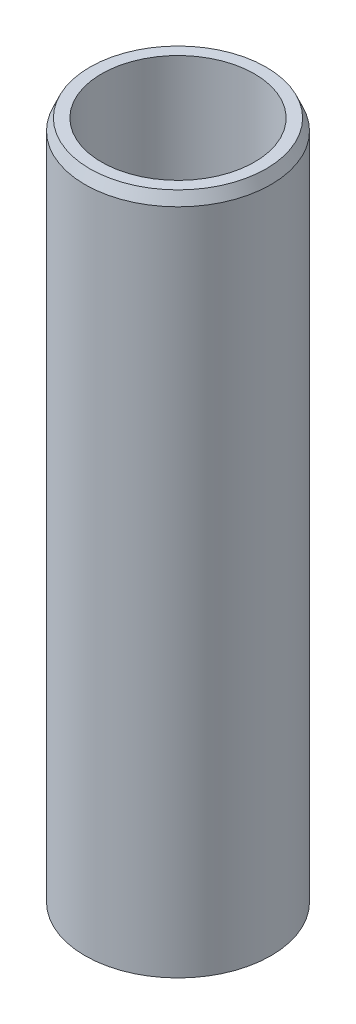
ISO-10303-21;
HEADER;
FILE_DESCRIPTION(('STEP AP214'),'2;1');
FILE_NAME('part.step','',(''),(''),'','','');
FILE_SCHEMA(('AUTOMOTIVE_DESIGN { 1 0 10303 214 1 1 1 1 }'));
ENDSEC;
DATA;
#1=APPLICATION_CONTEXT('core data for automotive mechanical design processes');
#2=APPLICATION_PROTOCOL_DEFINITION('international standard','automotive_design',2000,#1);
#3=PRODUCT_CONTEXT('',#1,'mechanical');
#4=PRODUCT('Part','Part','',(#3));
#5=PRODUCT_RELATED_PRODUCT_CATEGORY('part','',(#4));
#6=PRODUCT_DEFINITION_FORMATION('','',#4);
#7=PRODUCT_DEFINITION_CONTEXT('part definition',#1,'design');
#8=PRODUCT_DEFINITION('design','',#6,#7);
#9=PRODUCT_DEFINITION_SHAPE('','',#8);
#10=(LENGTH_UNIT() NAMED_UNIT(*) SI_UNIT(.MILLI.,.METRE.));
#11=(NAMED_UNIT(*) PLANE_ANGLE_UNIT() SI_UNIT($,.RADIAN.));
#12=(NAMED_UNIT(*) SI_UNIT($,.STERADIAN.) SOLID_ANGLE_UNIT());
#13=UNCERTAINTY_MEASURE_WITH_UNIT(LENGTH_MEASURE(1.E-05),#10,'distance_accuracy_value','');
#14=(GEOMETRIC_REPRESENTATION_CONTEXT(3) GLOBAL_UNCERTAINTY_ASSIGNED_CONTEXT((#13)) GLOBAL_UNIT_ASSIGNED_CONTEXT((#10,
#11,#12)) REPRESENTATION_CONTEXT('',''));
#15=CARTESIAN_POINT('',(0.,0.,0.));
#16=DIRECTION('',(0.,0.,1.));
#17=DIRECTION('',(1.,0.,0.));
#18=AXIS2_PLACEMENT_3D('',#15,#16,#17);
#19=CARTESIAN_POINT('',(0.,294.174973671221,0.));
#20=DIRECTION('',(0.,-1.,0.));
#21=DIRECTION('',(0.,0.,-1.));
#22=AXIS2_PLACEMENT_3D('',#19,#20,#21);
#23=CYLINDRICAL_SURFACE('',#22,40.);
#24=CARTESIAN_POINT('',(0.,289.34839764924,0.));
#25=DIRECTION('',(0.,1.,0.));
#26=DIRECTION('',(0.,0.,1.));
#27=AXIS2_PLACEMENT_3D('',#24,#25,#26);
#28=CIRCLE('',#27,40.);
#29=CARTESIAN_POINT('',(0.,289.34839764924,-40.));
#30=VERTEX_POINT('',#29);
#31=EDGE_CURVE('E50',#30,#30,#28,.F.);
#32=CARTESIAN_POINT('',(0.,2.09444269770964,0.));
#33=DIRECTION('',(0.,1.,0.));
#34=DIRECTION('',(0.,0.,1.));
#35=AXIS2_PLACEMENT_3D('',#32,#33,#34);
#36=CIRCLE('',#35,40.);
#37=CARTESIAN_POINT('',(0.,2.09444269770964,-40.));
#38=VERTEX_POINT('',#37);
#39=EDGE_CURVE('E51',#38,#38,#36,.T.);
#40=CARTESIAN_POINT('',(0.,289.34839764924,-40.));
#41=CARTESIAN_POINT('',(0.,286.356168951828,-40.));
#42=CARTESIAN_POINT('',(0.,283.363940254416,-40.));
#43=CARTESIAN_POINT('',(0.,277.379482859593,-40.));
#44=CARTESIAN_POINT('',(0.,274.387254162181,-40.));
#45=CARTESIAN_POINT('',(0.,268.402796767357,-40.));
#46=CARTESIAN_POINT('',(0.,265.410568069945,-40.));
#47=CARTESIAN_POINT('',(0.,259.426110675122,-40.));
#48=CARTESIAN_POINT('',(0.,256.43388197771,-40.));
#49=CARTESIAN_POINT('',(0.,250.449424582887,-40.));
#50=CARTESIAN_POINT('',(0.,247.457195885475,-40.));
#51=CARTESIAN_POINT('',(0.,241.472738490651,-40.));
#52=CARTESIAN_POINT('',(0.,238.48050979324,-40.));
#53=CARTESIAN_POINT('',(0.,232.496052398416,-40.));
#54=CARTESIAN_POINT('',(0.,229.503823701004,-40.));
#55=CARTESIAN_POINT('',(0.,223.519366306181,-40.));
#56=CARTESIAN_POINT('',(0.,220.527137608769,-40.));
#57=CARTESIAN_POINT('',(0.,214.542680213945,-40.));
#58=CARTESIAN_POINT('',(0.,211.550451516534,-40.));
#59=CARTESIAN_POINT('',(0.,205.56599412171,-40.));
#60=CARTESIAN_POINT('',(0.,202.573765424298,-40.));
#61=CARTESIAN_POINT('',(0.,196.589308029475,-40.));
#62=CARTESIAN_POINT('',(0.,193.597079332063,-40.));
#63=CARTESIAN_POINT('',(0.,187.612621937239,-40.));
#64=CARTESIAN_POINT('',(0.,184.620393239828,-40.));
#65=CARTESIAN_POINT('',(0.,178.635935845004,-40.));
#66=CARTESIAN_POINT('',(0.,175.643707147592,-40.));
#67=CARTESIAN_POINT('',(0.,169.659249752769,-40.));
#68=CARTESIAN_POINT('',(0.,166.667021055357,-40.));
#69=CARTESIAN_POINT('',(0.,160.682563660534,-40.));
#70=CARTESIAN_POINT('',(0.,157.690334963122,-40.));
#71=CARTESIAN_POINT('',(0.,151.705877568298,-40.));
#72=CARTESIAN_POINT('',(0.,148.713648870886,-40.));
#73=CARTESIAN_POINT('',(0.,142.729191476063,-40.));
#74=CARTESIAN_POINT('',(0.,139.736962778651,-40.));
#75=CARTESIAN_POINT('',(0.,133.752505383828,-40.));
#76=CARTESIAN_POINT('',(0.,130.760276686416,-40.));
#77=CARTESIAN_POINT('',(0.,124.775819291592,-40.));
#78=CARTESIAN_POINT('',(0.,121.78359059418,-40.));
#79=CARTESIAN_POINT('',(0.,115.799133199357,-40.));
#80=CARTESIAN_POINT('',(0.,112.806904501945,-40.));
#81=CARTESIAN_POINT('',(0.,106.822447107122,-40.));
#82=CARTESIAN_POINT('',(0.,103.83021840971,-40.));
#83=CARTESIAN_POINT('',(0.,97.8457610148863,-40.));
#84=CARTESIAN_POINT('',(0.,94.8535323174745,-40.));
#85=CARTESIAN_POINT('',(0.,88.869074922651,-40.));
#86=CARTESIAN_POINT('',(0.,85.8768462252392,-40.));
#87=CARTESIAN_POINT('',(0.,79.8923888304157,-40.));
#88=CARTESIAN_POINT('',(0.,76.9001601330039,-40.));
#89=CARTESIAN_POINT('',(0.,70.9157027381804,-40.));
#90=CARTESIAN_POINT('',(0.,67.9234740407686,-40.));
#91=CARTESIAN_POINT('',(0.,61.9390166459451,-40.));
#92=CARTESIAN_POINT('',(0.,58.9467879485333,-40.));
#93=CARTESIAN_POINT('',(0.,52.9623305537098,-40.));
#94=CARTESIAN_POINT('',(0.,49.970101856298,-40.));
#95=CARTESIAN_POINT('',(0.,43.9856444614744,-40.));
#96=CARTESIAN_POINT('',(0.,40.9934157640627,-40.));
#97=CARTESIAN_POINT('',(0.,35.0089583692391,-40.));
#98=CARTESIAN_POINT('',(0.,32.0167296718273,-40.));
#99=CARTESIAN_POINT('',(0.,26.0322722770038,-40.));
#100=CARTESIAN_POINT('',(0.,23.040043579592,-40.));
#101=CARTESIAN_POINT('',(0.,17.0555861847685,-40.));
#102=CARTESIAN_POINT('',(0.,14.0633574873567,-40.));
#103=CARTESIAN_POINT('',(0.,8.0789000925332,-40.));
#104=CARTESIAN_POINT('',(0.,5.08667139512142,-40.));
#105=CARTESIAN_POINT('',(0.,2.09444269770964,-40.));
#106=B_SPLINE_CURVE_WITH_KNOTS('',3,(#40,#41,#42,#43,#44,#45,#46,#47,#48,#49,#50,#51,#52,#53,
#54,#55,#56,#57,#58,#59,#60,#61,#62,#63,#64,#65,#66,#67,#68,#69,#70,#71,#72,#73,#74,#75,#76,#77,
#78,#79,#80,#81,#82,#83,#84,#85,#86,#87,#88,#89,#90,#91,#92,#93,#94,#95,#96,#97,#98,#99,#100,
#101,#102,#103,#104,#105),.UNSPECIFIED.,.F.,.F.,(4,2,2,2,2,2,2,2,2,2,2,2,2,2,2,2,2,2,2,2,2,2,2,
2,2,2,2,2,2,2,2,2,4),(0.,8.97668609223529,17.9533721844706,26.9300582767059,35.9067443689412,
44.8834304611765,53.8601165534119,62.8368026456472,71.8134887378825,80.7901748301178,
89.7668609223531,98.7435470145884,107.720233106824,116.696919199059,125.673605291294,
134.65029138353,143.626977475765,152.603663568,161.580349660236,170.557035752471,
179.533721844706,188.510407936942,197.487094029177,206.463780121412,215.440466213647,
224.417152305883,233.393838398118,242.370524490353,251.347210582589,260.323896674824,
269.300582767059,278.277268859295,287.25395495153),.UNSPECIFIED.);
#107=EDGE_CURVE('BSEAM39',#30,#38,#106,.T.);
#108=ORIENTED_EDGE('',*,*,#31,.T.);
#109=ORIENTED_EDGE('',*,*,#39,.T.);
#110=ORIENTED_EDGE('',*,*,#107,.T.);
#111=ORIENTED_EDGE('',*,*,#107,.F.);
#112=EDGE_LOOP('',(#108,#110,#109,#111));
#113=FACE_BOUND('',#112,.T.);
#114=ADVANCED_FACE('F39',(#113),#23,.T.);
#115=CARTESIAN_POINT('',(0.,294.174973671221,0.));
#116=DIRECTION('',(0.,1.,0.));
#117=DIRECTION('',(0.,0.,1.));
#118=AXIS2_PLACEMENT_3D('',#115,#116,#117);
#119=PLANE('',#118);
#120=CARTESIAN_POINT('',(0.,294.174973671221,0.));
#121=DIRECTION('',(0.,1.,0.));
#122=DIRECTION('',(0.,0.,1.));
#123=AXIS2_PLACEMENT_3D('',#120,#121,#122);
#124=CIRCLE('',#123,37.9055573022907);
#125=CARTESIAN_POINT('',(0.,294.174973671221,37.9055573022907));
#126=VERTEX_POINT('',#125);
#127=EDGE_CURVE('E54',#126,#126,#124,.T.);
#128=ORIENTED_EDGE('',*,*,#127,.T.);
#129=EDGE_LOOP('',(#128));
#130=FACE_BOUND('',#129,.T.);
#131=CARTESIAN_POINT('',(0.,294.174973671221,0.));
#132=DIRECTION('',(0.,1.,0.));
#133=DIRECTION('',(0.,0.,1.));
#134=AXIS2_PLACEMENT_3D('',#131,#132,#133);
#135=CIRCLE('',#134,32.8998280715255);
#136=CARTESIAN_POINT('',(0.,294.174973671221,-32.8998280715255));
#137=VERTEX_POINT('',#136);
#138=EDGE_CURVE('E58',#137,#137,#135,.T.);
#139=ORIENTED_EDGE('',*,*,#138,.F.);
#140=EDGE_LOOP('',(#139));
#141=FACE_BOUND('',#140,.T.);
#142=ADVANCED_FACE('F69',(#130,#141),#119,.T.);
#143=CARTESIAN_POINT('',(0.,0.,0.));
#144=DIRECTION('',(0.,1.,0.));
#145=DIRECTION('',(0.,0.,1.));
#146=AXIS2_PLACEMENT_3D('',#143,#144,#145);
#147=PLANE('',#146);
#148=CARTESIAN_POINT('',(0.,0.,0.));
#149=DIRECTION('',(0.,1.,0.));
#150=DIRECTION('',(0.,0.,1.));
#151=AXIS2_PLACEMENT_3D('',#148,#149,#150);
#152=CIRCLE('',#151,35.1734239780177);
#153=CARTESIAN_POINT('',(0.,0.,35.1734239780177));
#154=VERTEX_POINT('',#153);
#155=EDGE_CURVE('E10',#154,#154,#152,.F.);
#156=ORIENTED_EDGE('',*,*,#155,.T.);
#157=EDGE_LOOP('',(#156));
#158=FACE_BOUND('',#157,.T.);
#159=CARTESIAN_POINT('',(0.,0.,0.));
#160=DIRECTION('',(0.,1.,0.));
#161=DIRECTION('',(0.,0.,1.));
#162=AXIS2_PLACEMENT_3D('',#159,#160,#161);
#163=CIRCLE('',#162,32.8998280715255);
#164=CARTESIAN_POINT('',(0.,0.,-32.8998280715255));
#165=VERTEX_POINT('',#164);
#166=EDGE_CURVE('E63',#165,#165,#163,.T.);
#167=ORIENTED_EDGE('',*,*,#166,.T.);
#168=EDGE_LOOP('',(#167));
#169=FACE_BOUND('',#168,.T.);
#170=ADVANCED_FACE('F75',(#158,#169),#147,.F.);
#171=CARTESIAN_POINT('',(0.,294.174973671221,0.));
#172=DIRECTION('',(0.,-1.,0.));
#173=DIRECTION('',(0.,0.,-1.));
#174=AXIS2_PLACEMENT_3D('',#171,#172,#173);
#175=CYLINDRICAL_SURFACE('',#174,32.8998280715255);
#176=CARTESIAN_POINT('',(0.,294.174973671221,-32.8998280715255));
#177=CARTESIAN_POINT('',(0.,291.110651028813,-32.8998280715255));
#178=CARTESIAN_POINT('',(0.,288.046328386404,-32.8998280715255));
#179=CARTESIAN_POINT('',(0.,281.917683101587,-32.8998280715255));
#180=CARTESIAN_POINT('',(0.,278.853360459179,-32.8998280715255));
#181=CARTESIAN_POINT('',(0.,272.724715174361,-32.8998280715255));
#182=CARTESIAN_POINT('',(0.,269.660392531953,-32.8998280715255));
#183=CARTESIAN_POINT('',(0.,263.531747247136,-32.8998280715255));
#184=CARTESIAN_POINT('',(0.,260.467424604727,-32.8998280715255));
#185=CARTESIAN_POINT('',(0.,254.33877931991,-32.8998280715255));
#186=CARTESIAN_POINT('',(0.,251.274456677502,-32.8998280715255));
#187=CARTESIAN_POINT('',(0.,245.145811392685,-32.8998280715255));
#188=CARTESIAN_POINT('',(0.,242.081488750276,-32.8998280715255));
#189=CARTESIAN_POINT('',(0.,235.952843465459,-32.8998280715255));
#190=CARTESIAN_POINT('',(0.,232.88852082305,-32.8998280715255));
#191=CARTESIAN_POINT('',(0.,226.759875538233,-32.8998280715255));
#192=CARTESIAN_POINT('',(0.,223.695552895825,-32.8998280715255));
#193=CARTESIAN_POINT('',(0.,217.566907611008,-32.8998280715255));
#194=CARTESIAN_POINT('',(0.,214.502584968599,-32.8998280715255));
#195=CARTESIAN_POINT('',(0.,208.373939683782,-32.8998280715255));
#196=CARTESIAN_POINT('',(0.,205.309617041373,-32.8998280715255));
#197=CARTESIAN_POINT('',(0.,199.180971756556,-32.8998280715255));
#198=CARTESIAN_POINT('',(0.,196.116649114148,-32.8998280715255));
#199=CARTESIAN_POINT('',(0.,189.98800382933,-32.8998280715255));
#200=CARTESIAN_POINT('',(0.,186.923681186922,-32.8998280715255));
#201=CARTESIAN_POINT('',(0.,180.795035902105,-32.8998280715255));
#202=CARTESIAN_POINT('',(0.,177.730713259696,-32.8998280715255));
#203=CARTESIAN_POINT('',(0.,171.602067974879,-32.8998280715255));
#204=CARTESIAN_POINT('',(0.,168.537745332471,-32.8998280715255));
#205=CARTESIAN_POINT('',(0.,162.409100047653,-32.8998280715255));
#206=CARTESIAN_POINT('',(0.,159.344777405245,-32.8998280715255));
#207=CARTESIAN_POINT('',(0.,153.216132120428,-32.8998280715255));
#208=CARTESIAN_POINT('',(0.,150.151809478019,-32.8998280715255));
#209=CARTESIAN_POINT('',(0.,144.023164193202,-32.8998280715255));
#210=CARTESIAN_POINT('',(0.,140.958841550794,-32.8998280715255));
#211=CARTESIAN_POINT('',(0.,134.830196265976,-32.8998280715255));
#212=CARTESIAN_POINT('',(0.,131.765873623568,-32.8998280715255));
#213=CARTESIAN_POINT('',(0.,125.637228338751,-32.8998280715255));
#214=CARTESIAN_POINT('',(0.,122.572905696342,-32.8998280715255));
#215=CARTESIAN_POINT('',(0.,116.444260411525,-32.8998280715255));
#216=CARTESIAN_POINT('',(0.,113.379937769117,-32.8998280715255));
#217=CARTESIAN_POINT('',(0.,107.251292484299,-32.8998280715255));
#218=CARTESIAN_POINT('',(0.,104.186969841891,-32.8998280715255));
#219=CARTESIAN_POINT('',(0.,98.0583245570738,-32.8998280715255));
#220=CARTESIAN_POINT('',(0.,94.9940019146653,-32.8998280715255));
#221=CARTESIAN_POINT('',(0.,88.8653566298481,-32.8998280715255));
#222=CARTESIAN_POINT('',(0.,85.8010339874396,-32.8998280715255));
#223=CARTESIAN_POINT('',(0.,79.6723887026225,-32.8998280715255));
#224=CARTESIAN_POINT('',(0.,76.6080660602139,-32.8998280715255));
#225=CARTESIAN_POINT('',(0.,70.4794207753968,-32.8998280715255));
#226=CARTESIAN_POINT('',(0.,67.4150981329882,-32.8998280715255));
#227=CARTESIAN_POINT('',(0.,61.2864528481711,-32.8998280715255));
#228=CARTESIAN_POINT('',(0.,58.2221302057626,-32.8998280715255));
#229=CARTESIAN_POINT('',(0.,52.0934849209455,-32.8998280715255));
#230=CARTESIAN_POINT('',(0.,49.0291622785369,-32.8998280715255));
#231=CARTESIAN_POINT('',(0.,42.9005169937198,-32.8998280715255));
#232=CARTESIAN_POINT('',(0.,39.8361943513112,-32.8998280715255));
#233=CARTESIAN_POINT('',(0.,33.7075490664941,-32.8998280715255));
#234=CARTESIAN_POINT('',(0.,30.6432264240856,-32.8998280715255));
#235=CARTESIAN_POINT('',(0.,24.5145811392684,-32.8998280715255));
#236=CARTESIAN_POINT('',(0.,21.4502584968599,-32.8998280715255));
#237=CARTESIAN_POINT('',(0.,15.3216132120428,-32.8998280715255));
#238=CARTESIAN_POINT('',(0.,12.2572905696342,-32.8998280715255));
#239=CARTESIAN_POINT('',(0.,6.12864528481712,-32.8998280715255));
#240=CARTESIAN_POINT('',(0.,3.06432264240856,-32.8998280715255));
#241=CARTESIAN_POINT('',(0.,0.,-32.8998280715255));
#242=B_SPLINE_CURVE_WITH_KNOTS('',3,(#176,#177,#178,#179,#180,#181,#182,#183,#184,#185,#186,
#187,#188,#189,#190,#191,#192,#193,#194,#195,#196,#197,#198,#199,#200,#201,#202,#203,#204,#205,
#206,#207,#208,#209,#210,#211,#212,#213,#214,#215,#216,#217,#218,#219,#220,#221,#222,#223,#224,
#225,#226,#227,#228,#229,#230,#231,#232,#233,#234,#235,#236,#237,#238,#239,#240,#241),
.UNSPECIFIED.,.F.,.F.,(4,2,2,2,2,2,2,2,2,2,2,2,2,2,2,2,2,2,2,2,2,2,2,2,2,2,2,2,2,2,2,2,4),(0.,
9.19296792722563,18.3859358544513,27.578903781677,36.7718717089026,45.9648396361283,
55.157807563354,64.3507754905797,73.5437434178053,82.736711345031,91.9296792722566,
101.122647199482,110.315615126708,119.508583053934,128.701550981159,137.894518908385,
147.087486835611,156.280454762836,165.473422690062,174.666390617288,183.859358544513,
193.052326471739,202.245294398965,211.43826232619,220.631230253416,229.824198180642,
239.017166107867,248.210134035093,257.403101962319,266.596069889544,275.78903781677,
284.982005743996,294.174973671221),.UNSPECIFIED.);
#243=EDGE_CURVE('BSEAM70',#137,#165,#242,.T.);
#244=ORIENTED_EDGE('',*,*,#138,.T.);
#245=ORIENTED_EDGE('',*,*,#166,.F.);
#246=ORIENTED_EDGE('',*,*,#243,.T.);
#247=ORIENTED_EDGE('',*,*,#243,.F.);
#248=EDGE_LOOP('',(#244,#246,#245,#247));
#249=FACE_BOUND('',#248,.T.);
#250=ADVANCED_FACE('F70',(#249),#175,.F.);
#251=CARTESIAN_POINT('',(0.,294.174973671221,0.));
#252=DIRECTION('',(0.,-1.,0.));
#253=DIRECTION('',(0.,0.,-1.));
#254=AXIS2_PLACEMENT_3D('',#251,#252,#253);
#255=CONICAL_SURFACE('',#254,37.9055573022907,0.409418176979765);
#256=ORIENTED_EDGE('',*,*,#31,.F.);
#257=EDGE_LOOP('',(#256));
#258=FACE_BOUND('',#257,.T.);
#259=ORIENTED_EDGE('',*,*,#127,.F.);
#260=EDGE_LOOP('',(#259));
#261=FACE_BOUND('',#260,.T.);
#262=ADVANCED_FACE('F81',(#258,#261),#255,.T.);
#263=CARTESIAN_POINT('',(0.,2.09444269770964,0.));
#264=DIRECTION('',(0.,1.,0.));
#265=DIRECTION('',(0.,0.,1.));
#266=AXIS2_PLACEMENT_3D('',#263,#264,#265);
#267=CONICAL_SURFACE('',#266,40.,1.16137814981512);
#268=ORIENTED_EDGE('',*,*,#155,.F.);
#269=EDGE_LOOP('',(#268));
#270=FACE_BOUND('',#269,.T.);
#271=ORIENTED_EDGE('',*,*,#39,.F.);
#272=EDGE_LOOP('',(#271));
#273=FACE_BOUND('',#272,.T.);
#274=ADVANCED_FACE('F45',(#270,#273),#267,.T.);
#275=CLOSED_SHELL('',(#114,#142,#170,#250,#262,#274));
#276=MANIFOLD_SOLID_BREP('B2',#275);
#277=ADVANCED_BREP_SHAPE_REPRESENTATION('',(#18,#276),#14);
#278=SHAPE_DEFINITION_REPRESENTATION(#9,#277);
ENDSEC;
END-ISO-10303-21;
